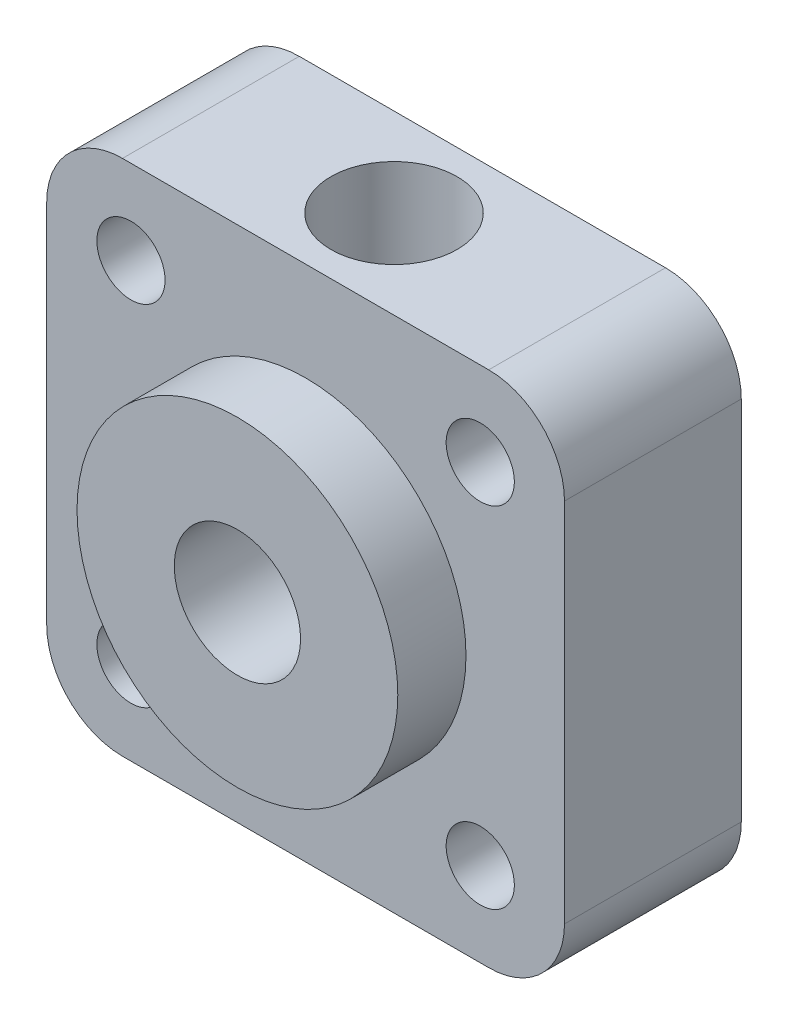
ISO-10303-21;
HEADER;
FILE_DESCRIPTION(('STEP AP214'),'2;1');
FILE_NAME('part.step','',(''),(''),'','','');
FILE_SCHEMA(('AUTOMOTIVE_DESIGN { 1 0 10303 214 1 1 1 1 }'));
ENDSEC;
DATA;
#1=APPLICATION_CONTEXT('core data for automotive mechanical design processes');
#2=APPLICATION_PROTOCOL_DEFINITION('international standard','automotive_design',2000,#1);
#3=PRODUCT_CONTEXT('',#1,'mechanical');
#4=PRODUCT('Part','Part','',(#3));
#5=PRODUCT_RELATED_PRODUCT_CATEGORY('part','',(#4));
#6=PRODUCT_DEFINITION_FORMATION('','',#4);
#7=PRODUCT_DEFINITION_CONTEXT('part definition',#1,'design');
#8=PRODUCT_DEFINITION('design','',#6,#7);
#9=PRODUCT_DEFINITION_SHAPE('','',#8);
#10=(LENGTH_UNIT() NAMED_UNIT(*) SI_UNIT(.MILLI.,.METRE.));
#11=(NAMED_UNIT(*) PLANE_ANGLE_UNIT() SI_UNIT($,.RADIAN.));
#12=(NAMED_UNIT(*) SI_UNIT($,.STERADIAN.) SOLID_ANGLE_UNIT());
#13=UNCERTAINTY_MEASURE_WITH_UNIT(LENGTH_MEASURE(1.E-05),#10,'distance_accuracy_value','');
#14=(GEOMETRIC_REPRESENTATION_CONTEXT(3) GLOBAL_UNCERTAINTY_ASSIGNED_CONTEXT((#13)) GLOBAL_UNIT_ASSIGNED_CONTEXT((#10,
#11,#12)) REPRESENTATION_CONTEXT('',''));
#15=CARTESIAN_POINT('',(0.,0.,0.));
#16=DIRECTION('',(0.,0.,1.));
#17=DIRECTION('',(1.,0.,0.));
#18=AXIS2_PLACEMENT_3D('',#15,#16,#17);
#19=CARTESIAN_POINT('',(0.,0.,7.));
#20=DIRECTION('',(0.,0.,1.));
#21=DIRECTION('',(1.,0.,0.));
#22=AXIS2_PLACEMENT_3D('',#19,#20,#21);
#23=PLANE('',#22);
#24=CARTESIAN_POINT('',(-6.91550432000444,-6.91550432000443,7.));
#25=DIRECTION('',(0.,0.,1.));
#26=DIRECTION('',(1.,0.,0.));
#27=AXIS2_PLACEMENT_3D('',#24,#25,#26);
#28=CIRCLE('',#27,1.35);
#29=CARTESIAN_POINT('',(-5.56550432000444,-6.91550432000443,7.));
#30=VERTEX_POINT('',#29);
#31=EDGE_CURVE('E111',#30,#30,#28,.T.);
#32=ORIENTED_EDGE('',*,*,#31,.F.);
#33=EDGE_LOOP('',(#32));
#34=FACE_BOUND('',#33,.T.);
#35=CARTESIAN_POINT('',(6.91550432000443,-6.91550432000443,7.));
#36=DIRECTION('',(0.,0.,1.));
#37=DIRECTION('',(1.,0.,0.));
#38=AXIS2_PLACEMENT_3D('',#35,#36,#37);
#39=CIRCLE('',#38,1.35);
#40=CARTESIAN_POINT('',(8.26550432000443,-6.91550432000443,7.));
#41=VERTEX_POINT('',#40);
#42=EDGE_CURVE('E117',#41,#41,#39,.T.);
#43=ORIENTED_EDGE('',*,*,#42,.F.);
#44=EDGE_LOOP('',(#43));
#45=FACE_BOUND('',#44,.T.);
#46=CARTESIAN_POINT('',(6.91550432000443,6.91550432000444,7.));
#47=DIRECTION('',(0.,0.,1.));
#48=DIRECTION('',(1.,0.,0.));
#49=AXIS2_PLACEMENT_3D('',#46,#47,#48);
#50=CIRCLE('',#49,1.35);
#51=CARTESIAN_POINT('',(8.26550432000443,6.91550432000444,7.));
#52=VERTEX_POINT('',#51);
#53=EDGE_CURVE('E123',#52,#52,#50,.T.);
#54=ORIENTED_EDGE('',*,*,#53,.F.);
#55=EDGE_LOOP('',(#54));
#56=FACE_BOUND('',#55,.T.);
#57=CARTESIAN_POINT('',(-6.91550432000444,6.91550432000443,7.));
#58=DIRECTION('',(0.,0.,1.));
#59=DIRECTION('',(1.,0.,0.));
#60=AXIS2_PLACEMENT_3D('',#57,#58,#59);
#61=CIRCLE('',#60,1.35000000000001);
#62=CARTESIAN_POINT('',(-5.56550432000443,6.91550432000443,7.));
#63=VERTEX_POINT('',#62);
#64=EDGE_CURVE('E129',#63,#63,#61,.T.);
#65=ORIENTED_EDGE('',*,*,#64,.F.);
#66=EDGE_LOOP('',(#65));
#67=FACE_BOUND('',#66,.T.);
#68=DIRECTION('',(0.,-1.,0.));
#69=VECTOR('',#68,1.);
#70=CARTESIAN_POINT('',(-10.25,10.25,7.));
#71=LINE('',#70,#69);
#72=CARTESIAN_POINT('',(-10.25,7.25000000000001,7.));
#73=VERTEX_POINT('',#72);
#74=CARTESIAN_POINT('',(-10.25,-7.24999999999999,7.));
#75=VERTEX_POINT('',#74);
#76=EDGE_CURVE('E156',#73,#75,#71,.T.);
#77=ORIENTED_EDGE('',*,*,#76,.T.);
#78=CARTESIAN_POINT('',(-7.25000000000001,-7.25,7.));
#79=DIRECTION('',(0.,0.,1.));
#80=DIRECTION('',(1.,0.,0.));
#81=AXIS2_PLACEMENT_3D('',#78,#79,#80);
#82=CIRCLE('',#81,3.);
#83=CARTESIAN_POINT('',(-7.25000000000001,-10.25,7.));
#84=VERTEX_POINT('',#83);
#85=EDGE_CURVE('E195',#75,#84,#82,.T.);
#86=ORIENTED_EDGE('',*,*,#85,.T.);
#87=DIRECTION('',(1.,0.,0.));
#88=VECTOR('',#87,1.);
#89=CARTESIAN_POINT('',(-10.25,-10.25,7.));
#90=LINE('',#89,#88);
#91=CARTESIAN_POINT('',(7.24999999999999,-10.25,7.));
#92=VERTEX_POINT('',#91);
#93=EDGE_CURVE('E159',#84,#92,#90,.T.);
#94=ORIENTED_EDGE('',*,*,#93,.T.);
#95=CARTESIAN_POINT('',(7.25,-7.24999999999999,7.));
#96=DIRECTION('',(0.,0.,1.));
#97=DIRECTION('',(1.,0.,0.));
#98=AXIS2_PLACEMENT_3D('',#95,#96,#97);
#99=CIRCLE('',#98,3.);
#100=CARTESIAN_POINT('',(10.25,-7.24999999999999,7.));
#101=VERTEX_POINT('',#100);
#102=EDGE_CURVE('E193',#92,#101,#99,.T.);
#103=ORIENTED_EDGE('',*,*,#102,.T.);
#104=DIRECTION('',(0.,1.,0.));
#105=VECTOR('',#104,1.);
#106=CARTESIAN_POINT('',(10.25,10.25,7.));
#107=LINE('',#106,#105);
#108=CARTESIAN_POINT('',(10.25,7.25000000000001,7.));
#109=VERTEX_POINT('',#108);
#110=EDGE_CURVE('E150',#101,#109,#107,.T.);
#111=ORIENTED_EDGE('',*,*,#110,.T.);
#112=CARTESIAN_POINT('',(7.24999999999999,7.25000000000001,7.));
#113=DIRECTION('',(0.,0.,1.));
#114=DIRECTION('',(1.,0.,0.));
#115=AXIS2_PLACEMENT_3D('',#112,#113,#114);
#116=CIRCLE('',#115,3.);
#117=CARTESIAN_POINT('',(7.24999999999999,10.25,7.));
#118=VERTEX_POINT('',#117);
#119=EDGE_CURVE('E191',#109,#118,#116,.T.);
#120=ORIENTED_EDGE('',*,*,#119,.T.);
#121=DIRECTION('',(-1.,0.,0.));
#122=VECTOR('',#121,1.);
#123=CARTESIAN_POINT('',(-10.25,10.25,7.));
#124=LINE('',#123,#122);
#125=CARTESIAN_POINT('',(-7.25000000000001,10.25,7.));
#126=VERTEX_POINT('',#125);
#127=EDGE_CURVE('E153',#118,#126,#124,.T.);
#128=ORIENTED_EDGE('',*,*,#127,.T.);
#129=CARTESIAN_POINT('',(-7.25000000000001,7.25000000000001,7.));
#130=DIRECTION('',(0.,0.,1.));
#131=DIRECTION('',(1.,0.,0.));
#132=AXIS2_PLACEMENT_3D('',#129,#130,#131);
#133=CIRCLE('',#132,3.);
#134=EDGE_CURVE('E189',#126,#73,#133,.T.);
#135=ORIENTED_EDGE('',*,*,#134,.T.);
#136=EDGE_LOOP('',(#77,#86,#94,#103,#111,#120,#128,#135));
#137=FACE_BOUND('',#136,.T.);
#138=CARTESIAN_POINT('',(0.,0.,7.));
#139=DIRECTION('',(0.,0.,1.));
#140=DIRECTION('',(1.,0.,0.));
#141=AXIS2_PLACEMENT_3D('',#138,#139,#140);
#142=CIRCLE('',#141,6.35);
#143=CARTESIAN_POINT('',(6.35,0.,7.));
#144=VERTEX_POINT('',#143);
#145=EDGE_CURVE('E141',#144,#144,#142,.T.);
#146=ORIENTED_EDGE('',*,*,#145,.F.);
#147=EDGE_LOOP('',(#146));
#148=FACE_BOUND('',#147,.T.);
#149=ADVANCED_FACE('F33',(#34,#45,#56,#67,#137,#148),#23,.T.);
#150=CARTESIAN_POINT('',(10.25,10.25,7.));
#151=DIRECTION('',(-1.,0.,0.));
#152=DIRECTION('',(0.,-1.,0.));
#153=AXIS2_PLACEMENT_3D('',#150,#151,#152);
#154=PLANE('',#153);
#155=ORIENTED_EDGE('',*,*,#110,.F.);
#156=DIRECTION('',(0.,0.,-1.));
#157=VECTOR('',#156,1.);
#158=CARTESIAN_POINT('',(10.25,-7.24999999999999,7.));
#159=LINE('',#158,#157);
#160=CARTESIAN_POINT('',(10.25,-7.24999999999999,0.));
#161=VERTEX_POINT('',#160);
#162=EDGE_CURVE('E199',#101,#161,#159,.T.);
#163=ORIENTED_EDGE('',*,*,#162,.T.);
#164=DIRECTION('',(0.,1.,0.));
#165=VECTOR('',#164,1.);
#166=CARTESIAN_POINT('',(10.25,10.25,0.));
#167=LINE('',#166,#165);
#168=CARTESIAN_POINT('',(10.25,7.25000000000001,0.));
#169=VERTEX_POINT('',#168);
#170=EDGE_CURVE('E147',#161,#169,#167,.T.);
#171=ORIENTED_EDGE('',*,*,#170,.T.);
#172=DIRECTION('',(0.,0.,-1.));
#173=VECTOR('',#172,1.);
#174=CARTESIAN_POINT('',(10.25,7.25000000000001,7.));
#175=LINE('',#174,#173);
#176=EDGE_CURVE('E197',#169,#109,#175,.F.);
#177=ORIENTED_EDGE('',*,*,#176,.T.);
#178=EDGE_LOOP('',(#155,#163,#171,#177));
#179=FACE_BOUND('',#178,.T.);
#180=ADVANCED_FACE('F205',(#179),#154,.F.);
#181=CARTESIAN_POINT('',(-10.25,10.25,7.));
#182=DIRECTION('',(0.,-1.,0.));
#183=DIRECTION('',(0.,0.,-1.));
#184=AXIS2_PLACEMENT_3D('',#181,#182,#183);
#185=PLANE('',#184);
#186=CARTESIAN_POINT('',(0.,10.25,3.5));
#187=DIRECTION('',(0.,1.,0.));
#188=DIRECTION('',(0.,0.,1.));
#189=AXIS2_PLACEMENT_3D('',#186,#187,#188);
#190=CIRCLE('',#189,2.5);
#191=CARTESIAN_POINT('',(0.,10.25,6.));
#192=VERTEX_POINT('',#191);
#193=EDGE_CURVE('E108',#192,#192,#190,.T.);
#194=ORIENTED_EDGE('',*,*,#193,.F.);
#195=EDGE_LOOP('',(#194));
#196=FACE_BOUND('',#195,.T.);
#197=ORIENTED_EDGE('',*,*,#127,.F.);
#198=DIRECTION('',(0.,0.,-1.));
#199=VECTOR('',#198,1.);
#200=CARTESIAN_POINT('',(7.24999999999999,10.25,7.));
#201=LINE('',#200,#199);
#202=CARTESIAN_POINT('',(7.24999999999999,10.25,0.));
#203=VERTEX_POINT('',#202);
#204=EDGE_CURVE('E11',#118,#203,#201,.T.);
#205=ORIENTED_EDGE('',*,*,#204,.T.);
#206=DIRECTION('',(-1.,0.,0.));
#207=VECTOR('',#206,1.);
#208=CARTESIAN_POINT('',(-10.25,10.25,0.));
#209=LINE('',#208,#207);
#210=CARTESIAN_POINT('',(-7.25000000000001,10.25,0.));
#211=VERTEX_POINT('',#210);
#212=EDGE_CURVE('E165',#203,#211,#209,.T.);
#213=ORIENTED_EDGE('',*,*,#212,.T.);
#214=DIRECTION('',(0.,0.,-1.));
#215=VECTOR('',#214,1.);
#216=CARTESIAN_POINT('',(-7.25000000000001,10.25,7.));
#217=LINE('',#216,#215);
#218=EDGE_CURVE('E41',#211,#126,#217,.F.);
#219=ORIENTED_EDGE('',*,*,#218,.T.);
#220=EDGE_LOOP('',(#197,#205,#213,#219));
#221=FACE_BOUND('',#220,.T.);
#222=ADVANCED_FACE('F217',(#196,#221),#185,.F.);
#223=CARTESIAN_POINT('',(-10.25,10.25,7.));
#224=DIRECTION('',(1.,0.,0.));
#225=DIRECTION('',(0.,1.,0.));
#226=AXIS2_PLACEMENT_3D('',#223,#224,#225);
#227=PLANE('',#226);
#228=DIRECTION('',(0.,-1.,0.));
#229=VECTOR('',#228,1.);
#230=CARTESIAN_POINT('',(-10.25,10.25,0.));
#231=LINE('',#230,#229);
#232=CARTESIAN_POINT('',(-10.25,7.25000000000001,0.));
#233=VERTEX_POINT('',#232);
#234=CARTESIAN_POINT('',(-10.25,-7.24999999999999,0.));
#235=VERTEX_POINT('',#234);
#236=EDGE_CURVE('E167',#233,#235,#231,.T.);
#237=ORIENTED_EDGE('',*,*,#236,.T.);
#238=DIRECTION('',(0.,0.,-1.));
#239=VECTOR('',#238,1.);
#240=CARTESIAN_POINT('',(-10.25,-7.25,7.));
#241=LINE('',#240,#239);
#242=EDGE_CURVE('E187',#235,#75,#241,.F.);
#243=ORIENTED_EDGE('',*,*,#242,.T.);
#244=ORIENTED_EDGE('',*,*,#76,.F.);
#245=DIRECTION('',(0.,0.,-1.));
#246=VECTOR('',#245,1.);
#247=CARTESIAN_POINT('',(-10.25,7.25000000000001,7.));
#248=LINE('',#247,#246);
#249=EDGE_CURVE('E184',#73,#233,#248,.T.);
#250=ORIENTED_EDGE('',*,*,#249,.T.);
#251=EDGE_LOOP('',(#237,#243,#244,#250));
#252=FACE_BOUND('',#251,.T.);
#253=ADVANCED_FACE('F226',(#252),#227,.F.);
#254=CARTESIAN_POINT('',(-10.25,-10.25,7.));
#255=DIRECTION('',(0.,1.,0.));
#256=DIRECTION('',(0.,0.,1.));
#257=AXIS2_PLACEMENT_3D('',#254,#255,#256);
#258=PLANE('',#257);
#259=ORIENTED_EDGE('',*,*,#93,.F.);
#260=DIRECTION('',(0.,0.,-1.));
#261=VECTOR('',#260,1.);
#262=CARTESIAN_POINT('',(-7.25000000000001,-10.25,7.));
#263=LINE('',#262,#261);
#264=CARTESIAN_POINT('',(-7.25000000000001,-10.25,0.));
#265=VERTEX_POINT('',#264);
#266=EDGE_CURVE('E173',#84,#265,#263,.T.);
#267=ORIENTED_EDGE('',*,*,#266,.T.);
#268=DIRECTION('',(1.,0.,0.));
#269=VECTOR('',#268,1.);
#270=CARTESIAN_POINT('',(-10.25,-10.25,0.));
#271=LINE('',#270,#269);
#272=CARTESIAN_POINT('',(7.24999999999999,-10.25,0.));
#273=VERTEX_POINT('',#272);
#274=EDGE_CURVE('E154',#265,#273,#271,.T.);
#275=ORIENTED_EDGE('',*,*,#274,.T.);
#276=DIRECTION('',(0.,0.,-1.));
#277=VECTOR('',#276,1.);
#278=CARTESIAN_POINT('',(7.25,-10.25,7.));
#279=LINE('',#278,#277);
#280=EDGE_CURVE('E162',#273,#92,#279,.F.);
#281=ORIENTED_EDGE('',*,*,#280,.T.);
#282=EDGE_LOOP('',(#259,#267,#275,#281));
#283=FACE_BOUND('',#282,.T.);
#284=ADVANCED_FACE('F234',(#283),#258,.F.);
#285=CARTESIAN_POINT('',(0.,0.,0.));
#286=DIRECTION('',(0.,0.,1.));
#287=DIRECTION('',(1.,0.,0.));
#288=AXIS2_PLACEMENT_3D('',#285,#286,#287);
#289=PLANE('',#288);
#290=CARTESIAN_POINT('',(-6.91550432000444,-6.91550432000443,0.));
#291=DIRECTION('',(0.,0.,1.));
#292=DIRECTION('',(1.,0.,0.));
#293=AXIS2_PLACEMENT_3D('',#290,#291,#292);
#294=CIRCLE('',#293,1.35);
#295=CARTESIAN_POINT('',(-5.56550432000444,-6.91550432000443,0.));
#296=VERTEX_POINT('',#295);
#297=EDGE_CURVE('E114',#296,#296,#294,.T.);
#298=ORIENTED_EDGE('',*,*,#297,.T.);
#299=EDGE_LOOP('',(#298));
#300=FACE_BOUND('',#299,.T.);
#301=CARTESIAN_POINT('',(6.91550432000443,-6.91550432000443,0.));
#302=DIRECTION('',(0.,0.,1.));
#303=DIRECTION('',(1.,0.,0.));
#304=AXIS2_PLACEMENT_3D('',#301,#302,#303);
#305=CIRCLE('',#304,1.35);
#306=CARTESIAN_POINT('',(8.26550432000443,-6.91550432000443,0.));
#307=VERTEX_POINT('',#306);
#308=EDGE_CURVE('E120',#307,#307,#305,.T.);
#309=ORIENTED_EDGE('',*,*,#308,.T.);
#310=EDGE_LOOP('',(#309));
#311=FACE_BOUND('',#310,.T.);
#312=CARTESIAN_POINT('',(6.91550432000443,6.91550432000444,0.));
#313=DIRECTION('',(0.,0.,1.));
#314=DIRECTION('',(1.,0.,0.));
#315=AXIS2_PLACEMENT_3D('',#312,#313,#314);
#316=CIRCLE('',#315,1.35);
#317=CARTESIAN_POINT('',(8.26550432000443,6.91550432000444,0.));
#318=VERTEX_POINT('',#317);
#319=EDGE_CURVE('E126',#318,#318,#316,.T.);
#320=ORIENTED_EDGE('',*,*,#319,.T.);
#321=EDGE_LOOP('',(#320));
#322=FACE_BOUND('',#321,.T.);
#323=CARTESIAN_POINT('',(-6.91550432000444,6.91550432000443,0.));
#324=DIRECTION('',(0.,0.,1.));
#325=DIRECTION('',(1.,0.,0.));
#326=AXIS2_PLACEMENT_3D('',#323,#324,#325);
#327=CIRCLE('',#326,1.35000000000001);
#328=CARTESIAN_POINT('',(-5.56550432000443,6.91550432000443,0.));
#329=VERTEX_POINT('',#328);
#330=EDGE_CURVE('E132',#329,#329,#327,.T.);
#331=ORIENTED_EDGE('',*,*,#330,.T.);
#332=EDGE_LOOP('',(#331));
#333=FACE_BOUND('',#332,.T.);
#334=CARTESIAN_POINT('',(0.,0.,0.));
#335=DIRECTION('',(0.,0.,1.));
#336=DIRECTION('',(1.,0.,0.));
#337=AXIS2_PLACEMENT_3D('',#334,#335,#336);
#338=CIRCLE('',#337,2.5);
#339=CARTESIAN_POINT('',(2.5,0.,0.));
#340=VERTEX_POINT('',#339);
#341=EDGE_CURVE('E138',#340,#340,#338,.T.);
#342=ORIENTED_EDGE('',*,*,#341,.T.);
#343=EDGE_LOOP('',(#342));
#344=FACE_BOUND('',#343,.T.);
#345=ORIENTED_EDGE('',*,*,#274,.F.);
#346=CARTESIAN_POINT('',(-7.25000000000001,-7.25,0.));
#347=DIRECTION('',(0.,0.,1.));
#348=DIRECTION('',(1.,0.,0.));
#349=AXIS2_PLACEMENT_3D('',#346,#347,#348);
#350=CIRCLE('',#349,3.);
#351=EDGE_CURVE('E182',#265,#235,#350,.F.);
#352=ORIENTED_EDGE('',*,*,#351,.T.);
#353=ORIENTED_EDGE('',*,*,#236,.F.);
#354=CARTESIAN_POINT('',(-7.25000000000001,7.25000000000001,0.));
#355=DIRECTION('',(0.,0.,1.));
#356=DIRECTION('',(1.,0.,0.));
#357=AXIS2_PLACEMENT_3D('',#354,#355,#356);
#358=CIRCLE('',#357,3.);
#359=EDGE_CURVE('E176',#233,#211,#358,.F.);
#360=ORIENTED_EDGE('',*,*,#359,.T.);
#361=ORIENTED_EDGE('',*,*,#212,.F.);
#362=CARTESIAN_POINT('',(7.24999999999999,7.25000000000001,0.));
#363=DIRECTION('',(0.,0.,1.));
#364=DIRECTION('',(1.,0.,0.));
#365=AXIS2_PLACEMENT_3D('',#362,#363,#364);
#366=CIRCLE('',#365,3.);
#367=EDGE_CURVE('E178',#203,#169,#366,.F.);
#368=ORIENTED_EDGE('',*,*,#367,.T.);
#369=ORIENTED_EDGE('',*,*,#170,.F.);
#370=CARTESIAN_POINT('',(7.25,-7.24999999999999,0.));
#371=DIRECTION('',(0.,0.,1.));
#372=DIRECTION('',(1.,0.,0.));
#373=AXIS2_PLACEMENT_3D('',#370,#371,#372);
#374=CIRCLE('',#373,3.);
#375=EDGE_CURVE('E180',#161,#273,#374,.F.);
#376=ORIENTED_EDGE('',*,*,#375,.T.);
#377=EDGE_LOOP('',(#345,#352,#353,#360,#361,#368,#369,#376));
#378=FACE_BOUND('',#377,.T.);
#379=ADVANCED_FACE('F211',(#300,#311,#322,#333,#344,#378),#289,.F.);
#380=CARTESIAN_POINT('',(-7.25000000000001,-7.25,7.));
#381=DIRECTION('',(0.,0.,-1.));
#382=DIRECTION('',(-1.,0.,0.));
#383=AXIS2_PLACEMENT_3D('',#380,#381,#382);
#384=CYLINDRICAL_SURFACE('',#383,3.);
#385=ORIENTED_EDGE('',*,*,#85,.F.);
#386=ORIENTED_EDGE('',*,*,#242,.F.);
#387=ORIENTED_EDGE('',*,*,#351,.F.);
#388=ORIENTED_EDGE('',*,*,#266,.F.);
#389=EDGE_LOOP('',(#385,#386,#387,#388));
#390=FACE_BOUND('',#389,.T.);
#391=ADVANCED_FACE('F231',(#390),#384,.T.);
#392=CARTESIAN_POINT('',(7.25,-7.24999999999999,7.));
#393=DIRECTION('',(0.,0.,-1.));
#394=DIRECTION('',(-1.,0.,0.));
#395=AXIS2_PLACEMENT_3D('',#392,#393,#394);
#396=CYLINDRICAL_SURFACE('',#395,3.);
#397=ORIENTED_EDGE('',*,*,#102,.F.);
#398=ORIENTED_EDGE('',*,*,#280,.F.);
#399=ORIENTED_EDGE('',*,*,#375,.F.);
#400=ORIENTED_EDGE('',*,*,#162,.F.);
#401=EDGE_LOOP('',(#397,#398,#399,#400));
#402=FACE_BOUND('',#401,.T.);
#403=ADVANCED_FACE('F236',(#402),#396,.T.);
#404=CARTESIAN_POINT('',(7.24999999999999,7.25000000000001,7.));
#405=DIRECTION('',(0.,0.,-1.));
#406=DIRECTION('',(-1.,0.,0.));
#407=AXIS2_PLACEMENT_3D('',#404,#405,#406);
#408=CYLINDRICAL_SURFACE('',#407,3.);
#409=ORIENTED_EDGE('',*,*,#119,.F.);
#410=ORIENTED_EDGE('',*,*,#176,.F.);
#411=ORIENTED_EDGE('',*,*,#367,.F.);
#412=ORIENTED_EDGE('',*,*,#204,.F.);
#413=EDGE_LOOP('',(#409,#410,#411,#412));
#414=FACE_BOUND('',#413,.T.);
#415=ADVANCED_FACE('F216',(#414),#408,.T.);
#416=CARTESIAN_POINT('',(-7.25000000000001,7.25000000000001,7.));
#417=DIRECTION('',(0.,0.,-1.));
#418=DIRECTION('',(-1.,0.,0.));
#419=AXIS2_PLACEMENT_3D('',#416,#417,#418);
#420=CYLINDRICAL_SURFACE('',#419,3.);
#421=ORIENTED_EDGE('',*,*,#134,.F.);
#422=ORIENTED_EDGE('',*,*,#218,.F.);
#423=ORIENTED_EDGE('',*,*,#359,.F.);
#424=ORIENTED_EDGE('',*,*,#249,.F.);
#425=EDGE_LOOP('',(#421,#422,#423,#424));
#426=FACE_BOUND('',#425,.T.);
#427=ADVANCED_FACE('F35',(#426),#420,.T.);
#428=CARTESIAN_POINT('',(0.,0.,9.7));
#429=DIRECTION('',(0.,0.,-1.));
#430=DIRECTION('',(-1.,0.,0.));
#431=AXIS2_PLACEMENT_3D('',#428,#429,#430);
#432=CYLINDRICAL_SURFACE('',#431,6.35);
#433=CARTESIAN_POINT('',(0.,0.,9.7));
#434=DIRECTION('',(0.,0.,1.));
#435=DIRECTION('',(1.,0.,0.));
#436=AXIS2_PLACEMENT_3D('',#433,#434,#435);
#437=CIRCLE('',#436,6.35);
#438=CARTESIAN_POINT('',(6.35,0.,9.7));
#439=VERTEX_POINT('',#438);
#440=EDGE_CURVE('E144',#439,#439,#437,.T.);
#441=ORIENTED_EDGE('',*,*,#440,.F.);
#442=EDGE_LOOP('',(#441));
#443=FACE_BOUND('',#442,.T.);
#444=ORIENTED_EDGE('',*,*,#145,.T.);
#445=EDGE_LOOP('',(#444));
#446=FACE_BOUND('',#445,.T.);
#447=ADVANCED_FACE('F255',(#443,#446),#432,.T.);
#448=CARTESIAN_POINT('',(0.,0.,9.7));
#449=DIRECTION('',(0.,0.,1.));
#450=DIRECTION('',(1.,0.,0.));
#451=AXIS2_PLACEMENT_3D('',#448,#449,#450);
#452=PLANE('',#451);
#453=CARTESIAN_POINT('',(0.,0.,9.7));
#454=DIRECTION('',(0.,0.,1.));
#455=DIRECTION('',(1.,0.,0.));
#456=AXIS2_PLACEMENT_3D('',#453,#454,#455);
#457=CIRCLE('',#456,2.5);
#458=CARTESIAN_POINT('',(2.5,0.,9.7));
#459=VERTEX_POINT('',#458);
#460=EDGE_CURVE('E135',#459,#459,#457,.T.);
#461=ORIENTED_EDGE('',*,*,#460,.F.);
#462=EDGE_LOOP('',(#461));
#463=FACE_BOUND('',#462,.T.);
#464=ORIENTED_EDGE('',*,*,#440,.T.);
#465=EDGE_LOOP('',(#464));
#466=FACE_BOUND('',#465,.T.);
#467=ADVANCED_FACE('F292',(#463,#466),#452,.T.);
#468=CARTESIAN_POINT('',(0.,0.,0.));
#469=DIRECTION('',(0.,0.,1.));
#470=DIRECTION('',(1.,0.,0.));
#471=AXIS2_PLACEMENT_3D('',#468,#469,#470);
#472=CYLINDRICAL_SURFACE('',#471,2.5);
#473=CARTESIAN_POINT('',(0.,0.,3.5));
#474=DIRECTION('',(0.,0.707106781186547,-0.707106781186547));
#475=DIRECTION('',(0.,0.707106781186547,0.707106781186547));
#476=AXIS2_PLACEMENT_3D('',#473,#474,#475);
#477=ELLIPSE('',#476,3.53553390593274,2.5);
#478=CARTESIAN_POINT('',(2.5,0.,3.5));
#479=VERTEX_POINT('',#478);
#480=CARTESIAN_POINT('',(-2.5,0.,3.5));
#481=VERTEX_POINT('',#480);
#482=EDGE_CURVE('E102',#479,#481,#477,.F.);
#483=ORIENTED_EDGE('',*,*,#482,.F.);
#484=CARTESIAN_POINT('',(0.,0.,3.5));
#485=DIRECTION('',(0.,0.707106781186547,0.707106781186547));
#486=DIRECTION('',(0.,0.707106781186547,-0.707106781186547));
#487=AXIS2_PLACEMENT_3D('',#484,#485,#486);
#488=ELLIPSE('',#487,3.53553390593274,2.5);
#489=EDGE_CURVE('E47',#481,#479,#488,.F.);
#490=ORIENTED_EDGE('',*,*,#489,.F.);
#491=EDGE_LOOP('',(#483,#490));
#492=FACE_BOUND('',#491,.T.);
#493=ORIENTED_EDGE('',*,*,#341,.F.);
#494=EDGE_LOOP('',(#493));
#495=FACE_BOUND('',#494,.T.);
#496=ORIENTED_EDGE('',*,*,#460,.T.);
#497=EDGE_LOOP('',(#496));
#498=FACE_BOUND('',#497,.T.);
#499=ADVANCED_FACE('F106',(#492,#495,#498),#472,.F.);
#500=CARTESIAN_POINT('',(-6.91550432000444,6.91550432000443,0.));
#501=DIRECTION('',(0.,0.,1.));
#502=DIRECTION('',(1.,0.,0.));
#503=AXIS2_PLACEMENT_3D('',#500,#501,#502);
#504=CYLINDRICAL_SURFACE('',#503,1.35000000000001);
#505=ORIENTED_EDGE('',*,*,#330,.F.);
#506=EDGE_LOOP('',(#505));
#507=FACE_BOUND('',#506,.T.);
#508=ORIENTED_EDGE('',*,*,#64,.T.);
#509=EDGE_LOOP('',(#508));
#510=FACE_BOUND('',#509,.T.);
#511=ADVANCED_FACE('F286',(#507,#510),#504,.F.);
#512=CARTESIAN_POINT('',(6.91550432000443,6.91550432000444,0.));
#513=DIRECTION('',(0.,0.,1.));
#514=DIRECTION('',(1.,0.,0.));
#515=AXIS2_PLACEMENT_3D('',#512,#513,#514);
#516=CYLINDRICAL_SURFACE('',#515,1.35);
#517=ORIENTED_EDGE('',*,*,#319,.F.);
#518=EDGE_LOOP('',(#517));
#519=FACE_BOUND('',#518,.T.);
#520=ORIENTED_EDGE('',*,*,#53,.T.);
#521=EDGE_LOOP('',(#520));
#522=FACE_BOUND('',#521,.T.);
#523=ADVANCED_FACE('F282',(#519,#522),#516,.F.);
#524=CARTESIAN_POINT('',(6.91550432000443,-6.91550432000443,0.));
#525=DIRECTION('',(0.,0.,1.));
#526=DIRECTION('',(1.,0.,0.));
#527=AXIS2_PLACEMENT_3D('',#524,#525,#526);
#528=CYLINDRICAL_SURFACE('',#527,1.35);
#529=ORIENTED_EDGE('',*,*,#308,.F.);
#530=EDGE_LOOP('',(#529));
#531=FACE_BOUND('',#530,.T.);
#532=ORIENTED_EDGE('',*,*,#42,.T.);
#533=EDGE_LOOP('',(#532));
#534=FACE_BOUND('',#533,.T.);
#535=ADVANCED_FACE('F276',(#531,#534),#528,.F.);
#536=CARTESIAN_POINT('',(-6.91550432000444,-6.91550432000443,0.));
#537=DIRECTION('',(0.,0.,1.));
#538=DIRECTION('',(1.,0.,0.));
#539=AXIS2_PLACEMENT_3D('',#536,#537,#538);
#540=CYLINDRICAL_SURFACE('',#539,1.35);
#541=ORIENTED_EDGE('',*,*,#297,.F.);
#542=EDGE_LOOP('',(#541));
#543=FACE_BOUND('',#542,.T.);
#544=ORIENTED_EDGE('',*,*,#31,.T.);
#545=EDGE_LOOP('',(#544));
#546=FACE_BOUND('',#545,.T.);
#547=ADVANCED_FACE('F271',(#543,#546),#540,.F.);
#548=CARTESIAN_POINT('',(0.,-10.251,3.5));
#549=DIRECTION('',(0.,1.,0.));
#550=DIRECTION('',(0.,0.,1.));
#551=AXIS2_PLACEMENT_3D('',#548,#549,#550);
#552=CYLINDRICAL_SURFACE('',#551,2.5);
#553=ORIENTED_EDGE('',*,*,#193,.T.);
#554=EDGE_LOOP('',(#553));
#555=FACE_BOUND('',#554,.T.);
#556=ORIENTED_EDGE('',*,*,#489,.T.);
#557=ORIENTED_EDGE('',*,*,#482,.T.);
#558=EDGE_LOOP('',(#556,#557));
#559=FACE_BOUND('',#558,.T.);
#560=ADVANCED_FACE('F103',(#555,#559),#552,.F.);
#561=CLOSED_SHELL('',(#149,#180,#222,#253,#284,#379,#391,#403,#415,#427,#447,#467,#499,#511,
#523,#535,#547,#560));
#562=MANIFOLD_SOLID_BREP('B2',#561);
#563=ADVANCED_BREP_SHAPE_REPRESENTATION('',(#18,#562),#14);
#564=SHAPE_DEFINITION_REPRESENTATION(#9,#563);
ENDSEC;
END-ISO-10303-21;
